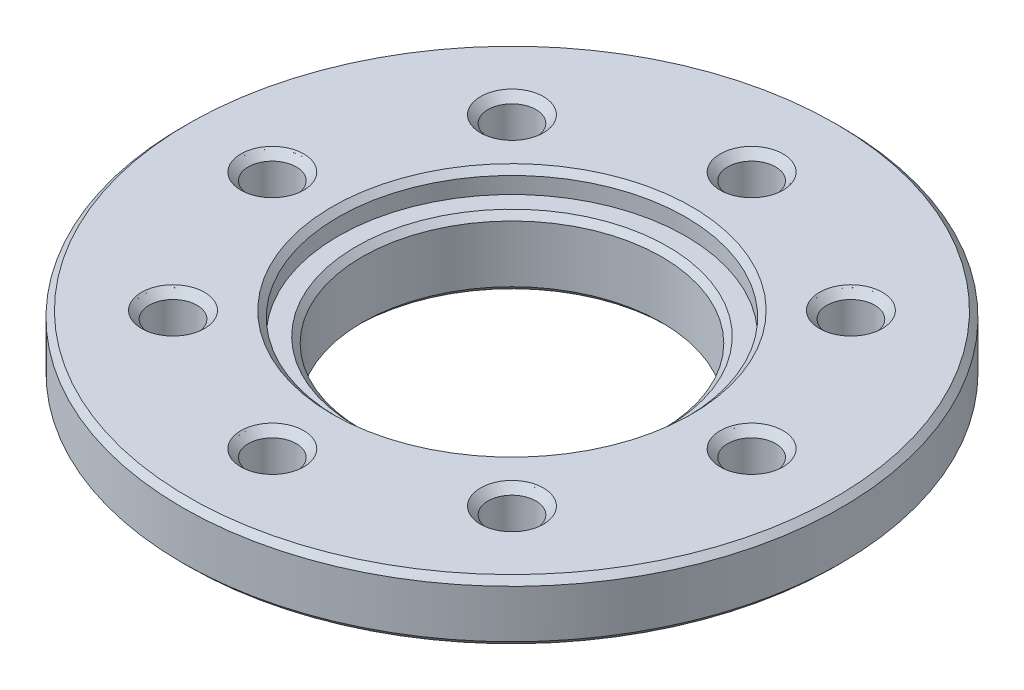
ISO-10303-21;
HEADER;
FILE_DESCRIPTION(('STEP AP214'),'2;1');
FILE_NAME('part.step','',(''),(''),'','','');
FILE_SCHEMA(('AUTOMOTIVE_DESIGN { 1 0 10303 214 1 1 1 1 }'));
ENDSEC;
DATA;
#1=APPLICATION_CONTEXT('core data for automotive mechanical design processes');
#2=APPLICATION_PROTOCOL_DEFINITION('international standard','automotive_design',2000,#1);
#3=PRODUCT_CONTEXT('',#1,'mechanical');
#4=PRODUCT('Part','Part','',(#3));
#5=PRODUCT_RELATED_PRODUCT_CATEGORY('part','',(#4));
#6=PRODUCT_DEFINITION_FORMATION('','',#4);
#7=PRODUCT_DEFINITION_CONTEXT('part definition',#1,'design');
#8=PRODUCT_DEFINITION('design','',#6,#7);
#9=PRODUCT_DEFINITION_SHAPE('','',#8);
#10=(LENGTH_UNIT() NAMED_UNIT(*) SI_UNIT(.MILLI.,.METRE.));
#11=(NAMED_UNIT(*) PLANE_ANGLE_UNIT() SI_UNIT($,.RADIAN.));
#12=(NAMED_UNIT(*) SI_UNIT($,.STERADIAN.) SOLID_ANGLE_UNIT());
#13=UNCERTAINTY_MEASURE_WITH_UNIT(LENGTH_MEASURE(1.E-05),#10,'distance_accuracy_value','');
#14=(GEOMETRIC_REPRESENTATION_CONTEXT(3) GLOBAL_UNCERTAINTY_ASSIGNED_CONTEXT((#13)) GLOBAL_UNIT_ASSIGNED_CONTEXT((#10,
#11,#12)) REPRESENTATION_CONTEXT('',''));
#15=CARTESIAN_POINT('',(0.,0.,0.));
#16=DIRECTION('',(0.,0.,1.));
#17=DIRECTION('',(1.,0.,0.));
#18=AXIS2_PLACEMENT_3D('',#15,#16,#17);
#19=CARTESIAN_POINT('',(5.656854249492,-3.52275,5.656854249492));
#20=DIRECTION('',(0.,1.,0.));
#21=DIRECTION('',(0.,0.,1.));
#22=AXIS2_PLACEMENT_3D('',#19,#20,#21);
#23=CYLINDRICAL_SURFACE('',#22,1.);
#24=CARTESIAN_POINT('',(5.656854249492,-0.0500000000000001,5.656854249492));
#25=DIRECTION('',(0.,1.,0.));
#26=DIRECTION('',(0.,0.,1.));
#27=AXIS2_PLACEMENT_3D('',#24,#25,#26);
#28=CIRCLE('',#27,1.);
#29=CARTESIAN_POINT('',(5.656854249492,-0.0500000000000001,6.656854249492));
#30=VERTEX_POINT('',#29);
#31=EDGE_CURVE('P0_E10',#30,#30,#28,.F.);
#32=ORIENTED_EDGE('',*,*,#31,.T.);
#33=EDGE_LOOP('',(#32));
#34=FACE_BOUND('',#33,.T.);
#35=CARTESIAN_POINT('',(5.656854249492,-2.,5.656854249492));
#36=DIRECTION('',(0.,1.,0.));
#37=DIRECTION('',(0.,0.,1.));
#38=AXIS2_PLACEMENT_3D('',#35,#36,#37);
#39=CIRCLE('',#38,1.);
#40=CARTESIAN_POINT('',(5.656854249492,-2.,6.656854249492));
#41=VERTEX_POINT('',#40);
#42=EDGE_CURVE('P0_E16',#41,#41,#39,.T.);
#43=ORIENTED_EDGE('',*,*,#42,.T.);
#44=EDGE_LOOP('',(#43));
#45=FACE_BOUND('',#44,.T.);
#46=ADVANCED_FACE('P0_F15',(#34,#45),#23,.T.);
#47=OPEN_SHELL('',(#46));
#48=SHELL_BASED_SURFACE_MODEL('P0_B1',(#47));
#49=CARTESIAN_POINT('',(0.,-0.750000000152795,0.));
#50=DIRECTION('',(0.,1.,0.));
#51=DIRECTION('',(0.,0.,1.));
#52=AXIS2_PLACEMENT_3D('',#49,#50,#51);
#53=CONICAL_SURFACE('',#52,5.19999999983156,0.785398163397448);
#54=CARTESIAN_POINT('',(0.,-0.750000000039108,0.));
#55=DIRECTION('',(0.,1.,0.));
#56=DIRECTION('',(0.,0.,1.));
#57=AXIS2_PLACEMENT_3D('',#54,#55,#56);
#58=CIRCLE('',#57,5.19999999994525);
#59=CARTESIAN_POINT('',(0.,-0.750000000039108,5.19999999994525));
#60=VERTEX_POINT('',#59);
#61=EDGE_CURVE('P1_E18',#60,#60,#58,.T.);
#62=ORIENTED_EDGE('',*,*,#61,.T.);
#63=EDGE_LOOP('',(#62));
#64=FACE_BOUND('',#63,.T.);
#65=CARTESIAN_POINT('',(0.,-0.95,0.));
#66=DIRECTION('',(0.,-1.,0.));
#67=DIRECTION('',(0.,0.,-1.));
#68=AXIS2_PLACEMENT_3D('',#65,#66,#67);
#69=CIRCLE('',#68,5.);
#70=CARTESIAN_POINT('',(0.,-0.95,-5.));
#71=VERTEX_POINT('',#70);
#72=EDGE_CURVE('P1_E30',#71,#71,#69,.T.);
#73=ORIENTED_EDGE('',*,*,#72,.T.);
#74=EDGE_LOOP('',(#73));
#75=FACE_BOUND('',#74,.T.);
#76=ADVANCED_FACE('P1_F15',(#64,#75),#53,.F.);
#77=CARTESIAN_POINT('',(0.,-0.75,0.));
#78=DIRECTION('',(0.,-1.,0.));
#79=DIRECTION('',(0.,0.,-1.));
#80=AXIS2_PLACEMENT_3D('',#77,#78,#79);
#81=PLANE('',#80);
#82=ORIENTED_EDGE('',*,*,#61,.F.);
#83=EDGE_LOOP('',(#82));
#84=FACE_BOUND('',#83,.T.);
#85=CARTESIAN_POINT('',(0.,-0.75,0.));
#86=DIRECTION('',(0.,-1.,0.));
#87=DIRECTION('',(0.,0.,-1.));
#88=AXIS2_PLACEMENT_3D('',#85,#86,#87);
#89=CIRCLE('',#88,5.8);
#90=CARTESIAN_POINT('',(0.,-0.75,-5.8));
#91=VERTEX_POINT('',#90);
#92=EDGE_CURVE('P1_E95',#91,#91,#89,.F.);
#93=ORIENTED_EDGE('',*,*,#92,.T.);
#94=EDGE_LOOP('',(#93));
#95=FACE_BOUND('',#94,.T.);
#96=ADVANCED_FACE('P1_F108',(#84,#95),#81,.F.);
#97=CARTESIAN_POINT('',(0.,0.1525,0.));
#98=DIRECTION('',(0.,-1.,0.));
#99=DIRECTION('',(0.,0.,-1.));
#100=AXIS2_PLACEMENT_3D('',#97,#98,#99);
#101=CYLINDRICAL_SURFACE('',#100,5.);
#102=CARTESIAN_POINT('',(0.,-2.84999999996671,0.));
#103=DIRECTION('',(0.,-1.,0.));
#104=DIRECTION('',(-1.,0.,0.));
#105=AXIS2_PLACEMENT_3D('',#102,#103,#104);
#106=CIRCLE('',#105,4.99999999993861);
#107=CARTESIAN_POINT('',(-4.99999999993861,-2.84999999996671,0.));
#108=VERTEX_POINT('',#107);
#109=EDGE_CURVE('P1_E97',#108,#108,#106,.T.);
#110=ORIENTED_EDGE('',*,*,#109,.T.);
#111=EDGE_LOOP('',(#110));
#112=FACE_BOUND('',#111,.T.);
#113=ORIENTED_EDGE('',*,*,#72,.F.);
#114=EDGE_LOOP('',(#113));
#115=FACE_BOUND('',#114,.T.);
#116=ADVANCED_FACE('P1_F110',(#112,#115),#101,.F.);
#117=CARTESIAN_POINT('',(0.,0.1525,0.));
#118=DIRECTION('',(0.,-1.,0.));
#119=DIRECTION('',(0.,0.,-1.));
#120=AXIS2_PLACEMENT_3D('',#117,#118,#119);
#121=CYLINDRICAL_SURFACE('',#120,5.8);
#122=ORIENTED_EDGE('',*,*,#92,.F.);
#123=EDGE_LOOP('',(#122));
#124=FACE_BOUND('',#123,.T.);
#125=CARTESIAN_POINT('',(0.,-0.200000000006639,0.));
#126=DIRECTION('',(0.,1.,0.));
#127=DIRECTION('',(1.,0.,0.));
#128=AXIS2_PLACEMENT_3D('',#125,#126,#127);
#129=CIRCLE('',#128,5.80000000002201);
#130=CARTESIAN_POINT('',(5.80000000002201,-0.200000000006639,0.));
#131=VERTEX_POINT('',#130);
#132=EDGE_CURVE('P1_E94',#131,#131,#129,.T.);
#133=ORIENTED_EDGE('',*,*,#132,.T.);
#134=EDGE_LOOP('',(#133));
#135=FACE_BOUND('',#134,.T.);
#136=ADVANCED_FACE('P1_F116',(#124,#135),#121,.F.);
#137=CARTESIAN_POINT('',(0.,-3.04999999985966,0.));
#138=DIRECTION('',(0.,-1.,0.));
#139=DIRECTION('',(0.,0.,-1.));
#140=AXIS2_PLACEMENT_3D('',#137,#138,#139);
#141=CONICAL_SURFACE('',#140,5.19999999983156,0.785398163397448);
#142=ORIENTED_EDGE('',*,*,#109,.F.);
#143=EDGE_LOOP('',(#142));
#144=FACE_BOUND('',#143,.T.);
#145=CARTESIAN_POINT('',(0.,-3.04999999997335,0.));
#146=DIRECTION('',(0.,-1.,0.));
#147=DIRECTION('',(0.,0.,-1.));
#148=AXIS2_PLACEMENT_3D('',#145,#146,#147);
#149=CIRCLE('',#148,5.19999999994525);
#150=CARTESIAN_POINT('',(0.,-3.04999999997335,-5.19999999994525));
#151=VERTEX_POINT('',#150);
#152=EDGE_CURVE('P1_E92',#151,#151,#149,.F.);
#153=ORIENTED_EDGE('',*,*,#152,.F.);
#154=EDGE_LOOP('',(#153));
#155=FACE_BOUND('',#154,.T.);
#156=ADVANCED_FACE('P1_F221',(#144,#155),#141,.F.);
#157=CARTESIAN_POINT('',(0.,-5.6843418860808E-11,0.));
#158=DIRECTION('',(0.,1.,0.));
#159=DIRECTION('',(0.,0.,1.));
#160=AXIS2_PLACEMENT_3D('',#157,#158,#159);
#161=CONICAL_SURFACE('',#160,5.99999999997181,0.785398163397448);
#162=CARTESIAN_POINT('',(0.,-5.6843418860808E-11,0.));
#163=DIRECTION('',(0.,1.,0.));
#164=DIRECTION('',(0.,0.,1.));
#165=AXIS2_PLACEMENT_3D('',#162,#163,#164);
#166=CIRCLE('',#165,5.99999999997181);
#167=CARTESIAN_POINT('',(0.,-5.6843418860808E-11,5.99999999997181));
#168=VERTEX_POINT('',#167);
#169=EDGE_CURVE('P1_E86',#168,#168,#166,.T.);
#170=ORIENTED_EDGE('',*,*,#169,.T.);
#171=EDGE_LOOP('',(#170));
#172=FACE_BOUND('',#171,.T.);
#173=ORIENTED_EDGE('',*,*,#132,.F.);
#174=EDGE_LOOP('',(#173));
#175=FACE_BOUND('',#174,.T.);
#176=ADVANCED_FACE('P1_F217',(#172,#175),#161,.F.);
#177=CARTESIAN_POINT('',(0.,-0.200000000000015,0.));
#178=DIRECTION('',(0.,-1.,0.));
#179=DIRECTION('',(0.,0.,-1.));
#180=AXIS2_PLACEMENT_3D('',#177,#178,#179);
#181=CONICAL_SURFACE('',#180,11.,0.7853981633973);
#182=CARTESIAN_POINT('',(0.,-0.2,0.));
#183=DIRECTION('',(0.,-1.,0.));
#184=DIRECTION('',(0.,0.,-1.));
#185=AXIS2_PLACEMENT_3D('',#182,#183,#184);
#186=CIRCLE('',#185,11.);
#187=CARTESIAN_POINT('',(0.,-0.2,-11.));
#188=VERTEX_POINT('',#187);
#189=EDGE_CURVE('P1_E85',#188,#188,#186,.T.);
#190=ORIENTED_EDGE('',*,*,#189,.F.);
#191=EDGE_LOOP('',(#190));
#192=FACE_BOUND('',#191,.T.);
#193=CARTESIAN_POINT('',(0.,0.,0.));
#194=DIRECTION('',(0.,-1.,0.));
#195=DIRECTION('',(0.,0.,-1.));
#196=AXIS2_PLACEMENT_3D('',#193,#194,#195);
#197=CIRCLE('',#196,10.8);
#198=CARTESIAN_POINT('',(0.,0.,-10.8));
#199=VERTEX_POINT('',#198);
#200=EDGE_CURVE('P1_E89',#199,#199,#197,.T.);
#201=ORIENTED_EDGE('',*,*,#200,.T.);
#202=EDGE_LOOP('',(#201));
#203=FACE_BOUND('',#202,.T.);
#204=ADVANCED_FACE('P1_F213',(#192,#203),#181,.T.);
#205=CARTESIAN_POINT('',(0.,-3.05,0.));
#206=DIRECTION('',(0.,-1.,0.));
#207=DIRECTION('',(0.,0.,-1.));
#208=AXIS2_PLACEMENT_3D('',#205,#206,#207);
#209=PLANE('',#208);
#210=ORIENTED_EDGE('',*,*,#152,.T.);
#211=EDGE_LOOP('',(#210));
#212=FACE_BOUND('',#211,.T.);
#213=CARTESIAN_POINT('',(0.,-3.0500000000302,0.));
#214=DIRECTION('',(0.,1.,0.));
#215=DIRECTION('',(0.,0.,1.));
#216=AXIS2_PLACEMENT_3D('',#213,#214,#215);
#217=CIRCLE('',#216,6.04999999995925);
#218=CARTESIAN_POINT('',(0.,-3.0500000000302,6.04999999995925));
#219=VERTEX_POINT('',#218);
#220=EDGE_CURVE('P1_E82',#219,#219,#217,.T.);
#221=ORIENTED_EDGE('',*,*,#220,.F.);
#222=EDGE_LOOP('',(#221));
#223=FACE_BOUND('',#222,.T.);
#224=ADVANCED_FACE('P1_F209',(#212,#223),#209,.T.);
#225=CARTESIAN_POINT('',(0.,0.,0.));
#226=DIRECTION('',(0.,-1.,0.));
#227=DIRECTION('',(0.,0.,-1.));
#228=AXIS2_PLACEMENT_3D('',#225,#226,#227);
#229=PLANE('',#228);
#230=CARTESIAN_POINT('',(-5.656854249492,0.,-5.656854249492));
#231=DIRECTION('',(0.,1.,0.));
#232=DIRECTION('',(0.,0.,1.));
#233=AXIS2_PLACEMENT_3D('',#230,#231,#232);
#234=CIRCLE('',#233,1.04999999997565);
#235=CARTESIAN_POINT('',(-5.656854249492,0.,-4.60685424951635));
#236=VERTEX_POINT('',#235);
#237=EDGE_CURVE('P1_E57',#236,#236,#234,.F.);
#238=ORIENTED_EDGE('',*,*,#237,.T.);
#239=EDGE_LOOP('',(#238));
#240=FACE_BOUND('',#239,.T.);
#241=CARTESIAN_POINT('',(-8.,0.,0.));
#242=DIRECTION('',(0.,1.,0.));
#243=DIRECTION('',(0.,0.,1.));
#244=AXIS2_PLACEMENT_3D('',#241,#242,#243);
#245=CIRCLE('',#244,1.05000000003929);
#246=CARTESIAN_POINT('',(-8.,0.,1.05000000003929));
#247=VERTEX_POINT('',#246);
#248=EDGE_CURVE('P1_E61',#247,#247,#245,.F.);
#249=ORIENTED_EDGE('',*,*,#248,.T.);
#250=EDGE_LOOP('',(#249));
#251=FACE_BOUND('',#250,.T.);
#252=CARTESIAN_POINT('',(-5.656854249492,0.,5.656854249492));
#253=DIRECTION('',(0.,1.,0.));
#254=DIRECTION('',(0.,0.,1.));
#255=AXIS2_PLACEMENT_3D('',#252,#253,#254);
#256=CIRCLE('',#255,1.04999999997565);
#257=CARTESIAN_POINT('',(-5.656854249492,0.,6.70685424946765));
#258=VERTEX_POINT('',#257);
#259=EDGE_CURVE('P1_E64',#258,#258,#256,.F.);
#260=ORIENTED_EDGE('',*,*,#259,.T.);
#261=EDGE_LOOP('',(#260));
#262=FACE_BOUND('',#261,.T.);
#263=CARTESIAN_POINT('',(0.,-5.6843418860808E-11,8.));
#264=DIRECTION('',(0.,1.,0.));
#265=DIRECTION('',(0.,0.,1.));
#266=AXIS2_PLACEMENT_3D('',#263,#264,#265);
#267=CIRCLE('',#266,1.04999999990696);
#268=CARTESIAN_POINT('',(0.,-5.6843418860808E-11,9.04999999990696));
#269=VERTEX_POINT('',#268);
#270=EDGE_CURVE('P1_E67',#269,#269,#267,.F.);
#271=ORIENTED_EDGE('',*,*,#270,.T.);
#272=EDGE_LOOP('',(#271));
#273=FACE_BOUND('',#272,.T.);
#274=CARTESIAN_POINT('',(5.656854249492,0.,5.656854249492));
#275=DIRECTION('',(0.,1.,0.));
#276=DIRECTION('',(0.,0.,1.));
#277=AXIS2_PLACEMENT_3D('',#274,#275,#276);
#278=CIRCLE('',#277,1.04999999995195);
#279=CARTESIAN_POINT('',(5.656854249492,0.,6.70685424944395));
#280=VERTEX_POINT('',#279);
#281=EDGE_CURVE('P1_E70',#280,#280,#278,.F.);
#282=ORIENTED_EDGE('',*,*,#281,.T.);
#283=EDGE_LOOP('',(#282));
#284=FACE_BOUND('',#283,.T.);
#285=CARTESIAN_POINT('',(8.,0.,0.));
#286=DIRECTION('',(0.,1.,0.));
#287=DIRECTION('',(0.,0.,1.));
#288=AXIS2_PLACEMENT_3D('',#285,#286,#287);
#289=CIRCLE('',#288,1.050000000002);
#290=CARTESIAN_POINT('',(8.,0.,1.050000000002));
#291=VERTEX_POINT('',#290);
#292=EDGE_CURVE('P1_E73',#291,#291,#289,.F.);
#293=ORIENTED_EDGE('',*,*,#292,.T.);
#294=EDGE_LOOP('',(#293));
#295=FACE_BOUND('',#294,.T.);
#296=CARTESIAN_POINT('',(5.656854249492,0.,-5.656854249492));
#297=DIRECTION('',(0.,1.,0.));
#298=DIRECTION('',(0.,0.,1.));
#299=AXIS2_PLACEMENT_3D('',#296,#297,#298);
#300=CIRCLE('',#299,1.04999999995195);
#301=CARTESIAN_POINT('',(5.656854249492,0.,-4.60685424954005));
#302=VERTEX_POINT('',#301);
#303=EDGE_CURVE('P1_E76',#302,#302,#300,.F.);
#304=ORIENTED_EDGE('',*,*,#303,.T.);
#305=EDGE_LOOP('',(#304));
#306=FACE_BOUND('',#305,.T.);
#307=CARTESIAN_POINT('',(0.,-5.6843418860808E-11,-8.));
#308=DIRECTION('',(0.,1.,0.));
#309=DIRECTION('',(0.,0.,1.));
#310=AXIS2_PLACEMENT_3D('',#307,#308,#309);
#311=CIRCLE('',#310,1.04999999990696);
#312=CARTESIAN_POINT('',(0.,-5.6843418860808E-11,-6.95000000009304));
#313=VERTEX_POINT('',#312);
#314=EDGE_CURVE('P1_E79',#313,#313,#311,.F.);
#315=ORIENTED_EDGE('',*,*,#314,.T.);
#316=EDGE_LOOP('',(#315));
#317=FACE_BOUND('',#316,.T.);
#318=ORIENTED_EDGE('',*,*,#169,.F.);
#319=EDGE_LOOP('',(#318));
#320=FACE_BOUND('',#319,.T.);
#321=ORIENTED_EDGE('',*,*,#200,.F.);
#322=EDGE_LOOP('',(#321));
#323=FACE_BOUND('',#322,.T.);
#324=ADVANCED_FACE('P1_F205',(#240,#251,#262,#273,#284,#295,#306,#317,#320,#323),#229,.F.);
#325=CARTESIAN_POINT('',(0.,0.1525,0.));
#326=DIRECTION('',(0.,-1.,0.));
#327=DIRECTION('',(0.,0.,-1.));
#328=AXIS2_PLACEMENT_3D('',#325,#326,#327);
#329=CYLINDRICAL_SURFACE('',#328,11.);
#330=CARTESIAN_POINT('',(0.,-1.79999999999999,0.));
#331=DIRECTION('',(0.,1.,0.));
#332=DIRECTION('',(1.,0.,0.));
#333=AXIS2_PLACEMENT_3D('',#330,#331,#332);
#334=CIRCLE('',#333,11.);
#335=CARTESIAN_POINT('',(11.,-1.79999999999998,0.));
#336=VERTEX_POINT('',#335);
#337=EDGE_CURVE('P1_E60',#336,#336,#334,.F.);
#338=ORIENTED_EDGE('',*,*,#337,.F.);
#339=EDGE_LOOP('',(#338));
#340=FACE_BOUND('',#339,.T.);
#341=ORIENTED_EDGE('',*,*,#189,.T.);
#342=EDGE_LOOP('',(#341));
#343=FACE_BOUND('',#342,.T.);
#344=ADVANCED_FACE('P1_F201',(#340,#343),#329,.T.);
#345=CARTESIAN_POINT('',(0.,-2.8500000000804,0.));
#346=DIRECTION('',(0.,1.,0.));
#347=DIRECTION('',(0.,0.,1.));
#348=AXIS2_PLACEMENT_3D('',#345,#346,#347);
#349=CONICAL_SURFACE('',#348,6.24999999990905,0.785398163397448);
#350=ORIENTED_EDGE('',*,*,#220,.T.);
#351=EDGE_LOOP('',(#350));
#352=FACE_BOUND('',#351,.T.);
#353=CARTESIAN_POINT('',(0.,-2.85,0.));
#354=DIRECTION('',(0.,-1.,0.));
#355=DIRECTION('',(0.,0.,-1.));
#356=AXIS2_PLACEMENT_3D('',#353,#354,#355);
#357=CIRCLE('',#356,6.25);
#358=CARTESIAN_POINT('',(0.,-2.85,-6.25));
#359=VERTEX_POINT('',#358);
#360=EDGE_CURVE('P1_E240',#359,#359,#357,.F.);
#361=ORIENTED_EDGE('',*,*,#360,.F.);
#362=EDGE_LOOP('',(#361));
#363=FACE_BOUND('',#362,.T.);
#364=ADVANCED_FACE('P1_F197',(#352,#363),#349,.T.);
#365=CARTESIAN_POINT('',(0.,-1.70530256582424E-10,-8.));
#366=DIRECTION('',(0.,1.,0.));
#367=DIRECTION('',(0.,0.,1.));
#368=AXIS2_PLACEMENT_3D('',#365,#366,#367);
#369=CONICAL_SURFACE('',#368,1.04999999979327,0.785398163397448);
#370=CARTESIAN_POINT('',(0.,-0.25,-8.));
#371=DIRECTION('',(0.,1.,0.));
#372=DIRECTION('',(0.,0.,1.));
#373=AXIS2_PLACEMENT_3D('',#370,#371,#372);
#374=CIRCLE('',#373,0.8);
#375=CARTESIAN_POINT('',(0.,-0.25,-7.2));
#376=VERTEX_POINT('',#375);
#377=EDGE_CURVE('P1_E243',#376,#376,#374,.F.);
#378=ORIENTED_EDGE('',*,*,#377,.T.);
#379=EDGE_LOOP('',(#378));
#380=FACE_BOUND('',#379,.T.);
#381=ORIENTED_EDGE('',*,*,#314,.F.);
#382=EDGE_LOOP('',(#381));
#383=FACE_BOUND('',#382,.T.);
#384=ADVANCED_FACE('P1_F193',(#380,#383),#369,.F.);
#385=CARTESIAN_POINT('',(5.656854249492,-5.6843418860808E-11,-5.656854249492));
#386=DIRECTION('',(0.,1.,0.));
#387=DIRECTION('',(0.,0.,1.));
#388=AXIS2_PLACEMENT_3D('',#385,#386,#387);
#389=CONICAL_SURFACE('',#388,1.04999999989511,0.785398163283761);
#390=CARTESIAN_POINT('',(5.656854249492,-0.25,-5.656854249492));
#391=DIRECTION('',(0.,1.,0.));
#392=DIRECTION('',(0.,0.,1.));
#393=AXIS2_PLACEMENT_3D('',#390,#391,#392);
#394=CIRCLE('',#393,0.8);
#395=CARTESIAN_POINT('',(5.656854249492,-0.25,-4.856854249492));
#396=VERTEX_POINT('',#395);
#397=EDGE_CURVE('P1_E246',#396,#396,#394,.F.);
#398=ORIENTED_EDGE('',*,*,#397,.T.);
#399=EDGE_LOOP('',(#398));
#400=FACE_BOUND('',#399,.T.);
#401=ORIENTED_EDGE('',*,*,#303,.F.);
#402=EDGE_LOOP('',(#401));
#403=FACE_BOUND('',#402,.T.);
#404=ADVANCED_FACE('P1_F189',(#400,#403),#389,.F.);
#405=CARTESIAN_POINT('',(8.,-1.13686837721616E-10,0.));
#406=DIRECTION('',(0.,1.,0.));
#407=DIRECTION('',(0.,0.,1.));
#408=AXIS2_PLACEMENT_3D('',#405,#406,#407);
#409=CONICAL_SURFACE('',#408,1.04999999988831,0.785398163397448);
#410=CARTESIAN_POINT('',(8.,-0.25,0.));
#411=DIRECTION('',(0.,1.,0.));
#412=DIRECTION('',(0.,0.,1.));
#413=AXIS2_PLACEMENT_3D('',#410,#411,#412);
#414=CIRCLE('',#413,0.8);
#415=CARTESIAN_POINT('',(8.,-0.25,0.8));
#416=VERTEX_POINT('',#415);
#417=EDGE_CURVE('P1_E249',#416,#416,#414,.F.);
#418=ORIENTED_EDGE('',*,*,#417,.T.);
#419=EDGE_LOOP('',(#418));
#420=FACE_BOUND('',#419,.T.);
#421=ORIENTED_EDGE('',*,*,#292,.F.);
#422=EDGE_LOOP('',(#421));
#423=FACE_BOUND('',#422,.T.);
#424=ADVANCED_FACE('P1_F185',(#420,#423),#409,.F.);
#425=CARTESIAN_POINT('',(5.656854249492,-5.6843418860808E-11,5.656854249492));
#426=DIRECTION('',(0.,1.,0.));
#427=DIRECTION('',(0.,0.,1.));
#428=AXIS2_PLACEMENT_3D('',#425,#426,#427);
#429=CONICAL_SURFACE('',#428,1.04999999989511,0.785398163283761);
#430=CARTESIAN_POINT('',(5.656854249492,-0.25,5.656854249492));
#431=DIRECTION('',(0.,1.,0.));
#432=DIRECTION('',(0.,0.,1.));
#433=AXIS2_PLACEMENT_3D('',#430,#431,#432);
#434=CIRCLE('',#433,0.8);
#435=CARTESIAN_POINT('',(5.656854249492,-0.25,6.456854249492));
#436=VERTEX_POINT('',#435);
#437=EDGE_CURVE('P1_E252',#436,#436,#434,.F.);
#438=ORIENTED_EDGE('',*,*,#437,.T.);
#439=EDGE_LOOP('',(#438));
#440=FACE_BOUND('',#439,.T.);
#441=ORIENTED_EDGE('',*,*,#281,.F.);
#442=EDGE_LOOP('',(#441));
#443=FACE_BOUND('',#442,.T.);
#444=ADVANCED_FACE('P1_F181',(#440,#443),#429,.F.);
#445=CARTESIAN_POINT('',(0.,-1.70530256582424E-10,8.));
#446=DIRECTION('',(0.,1.,0.));
#447=DIRECTION('',(0.,0.,1.));
#448=AXIS2_PLACEMENT_3D('',#445,#446,#447);
#449=CONICAL_SURFACE('',#448,1.04999999979327,0.785398163397448);
#450=CARTESIAN_POINT('',(0.,-0.25,8.));
#451=DIRECTION('',(0.,1.,0.));
#452=DIRECTION('',(0.,0.,1.));
#453=AXIS2_PLACEMENT_3D('',#450,#451,#452);
#454=CIRCLE('',#453,0.8);
#455=CARTESIAN_POINT('',(0.,-0.25,8.8));
#456=VERTEX_POINT('',#455);
#457=EDGE_CURVE('P1_E255',#456,#456,#454,.F.);
#458=ORIENTED_EDGE('',*,*,#457,.T.);
#459=EDGE_LOOP('',(#458));
#460=FACE_BOUND('',#459,.T.);
#461=ORIENTED_EDGE('',*,*,#270,.F.);
#462=EDGE_LOOP('',(#461));
#463=FACE_BOUND('',#462,.T.);
#464=ADVANCED_FACE('P1_F177',(#460,#463),#449,.F.);
#465=CARTESIAN_POINT('',(-5.656854249492,-5.6843418860808E-11,5.656854249492));
#466=DIRECTION('',(0.,1.,0.));
#467=DIRECTION('',(0.,0.,1.));
#468=AXIS2_PLACEMENT_3D('',#465,#466,#467);
#469=CONICAL_SURFACE('',#468,1.04999999991881,0.785398163397448);
#470=CARTESIAN_POINT('',(-5.656854249492,-0.25,5.656854249492));
#471=DIRECTION('',(0.,1.,0.));
#472=DIRECTION('',(0.,0.,1.));
#473=AXIS2_PLACEMENT_3D('',#470,#471,#472);
#474=CIRCLE('',#473,0.8);
#475=CARTESIAN_POINT('',(-5.656854249492,-0.25,6.456854249492));
#476=VERTEX_POINT('',#475);
#477=EDGE_CURVE('P1_E258',#476,#476,#474,.F.);
#478=ORIENTED_EDGE('',*,*,#477,.T.);
#479=EDGE_LOOP('',(#478));
#480=FACE_BOUND('',#479,.T.);
#481=ORIENTED_EDGE('',*,*,#259,.F.);
#482=EDGE_LOOP('',(#481));
#483=FACE_BOUND('',#482,.T.);
#484=ADVANCED_FACE('P1_F173',(#480,#483),#469,.F.);
#485=CARTESIAN_POINT('',(-8.,-5.6843418860808E-11,0.));
#486=DIRECTION('',(0.,1.,0.));
#487=DIRECTION('',(0.,0.,1.));
#488=AXIS2_PLACEMENT_3D('',#485,#486,#487);
#489=CONICAL_SURFACE('',#488,1.04999999998245,0.785398163397448);
#490=CARTESIAN_POINT('',(-8.,-0.25,0.));
#491=DIRECTION('',(0.,1.,0.));
#492=DIRECTION('',(0.,0.,1.));
#493=AXIS2_PLACEMENT_3D('',#490,#491,#492);
#494=CIRCLE('',#493,0.8);
#495=CARTESIAN_POINT('',(-8.,-0.25,0.8));
#496=VERTEX_POINT('',#495);
#497=EDGE_CURVE('P1_E261',#496,#496,#494,.F.);
#498=ORIENTED_EDGE('',*,*,#497,.T.);
#499=EDGE_LOOP('',(#498));
#500=FACE_BOUND('',#499,.T.);
#501=ORIENTED_EDGE('',*,*,#248,.F.);
#502=EDGE_LOOP('',(#501));
#503=FACE_BOUND('',#502,.T.);
#504=ADVANCED_FACE('P1_F169',(#500,#503),#489,.F.);
#505=CARTESIAN_POINT('',(-5.656854249492,-5.6843418860808E-11,-5.656854249492));
#506=DIRECTION('',(0.,1.,0.));
#507=DIRECTION('',(0.,0.,1.));
#508=AXIS2_PLACEMENT_3D('',#505,#506,#507);
#509=CONICAL_SURFACE('',#508,1.04999999991881,0.785398163397448);
#510=CARTESIAN_POINT('',(-5.656854249492,-0.25,-5.656854249492));
#511=DIRECTION('',(0.,1.,0.));
#512=DIRECTION('',(0.,0.,1.));
#513=AXIS2_PLACEMENT_3D('',#510,#511,#512);
#514=CIRCLE('',#513,0.8);
#515=CARTESIAN_POINT('',(-5.656854249492,-0.25,-4.856854249492));
#516=VERTEX_POINT('',#515);
#517=EDGE_CURVE('P1_E56',#516,#516,#514,.F.);
#518=ORIENTED_EDGE('',*,*,#517,.T.);
#519=EDGE_LOOP('',(#518));
#520=FACE_BOUND('',#519,.T.);
#521=ORIENTED_EDGE('',*,*,#237,.F.);
#522=EDGE_LOOP('',(#521));
#523=FACE_BOUND('',#522,.T.);
#524=ADVANCED_FACE('P1_F165',(#520,#523),#509,.F.);
#525=CARTESIAN_POINT('',(0.,-1.79999999999999,0.));
#526=DIRECTION('',(0.,1.,0.));
#527=DIRECTION('',(0.,0.,1.));
#528=AXIS2_PLACEMENT_3D('',#525,#526,#527);
#529=CONICAL_SURFACE('',#528,11.,0.785398163397302);
#530=CARTESIAN_POINT('',(0.,-2.00000000000001,0.));
#531=DIRECTION('',(0.,1.,0.));
#532=DIRECTION('',(0.,0.,1.));
#533=AXIS2_PLACEMENT_3D('',#530,#531,#532);
#534=CIRCLE('',#533,10.8);
#535=CARTESIAN_POINT('',(0.,-2.00000000000001,10.8));
#536=VERTEX_POINT('',#535);
#537=EDGE_CURVE('P1_E53',#536,#536,#534,.F.);
#538=ORIENTED_EDGE('',*,*,#537,.F.);
#539=EDGE_LOOP('',(#538));
#540=FACE_BOUND('',#539,.T.);
#541=ORIENTED_EDGE('',*,*,#337,.T.);
#542=EDGE_LOOP('',(#541));
#543=FACE_BOUND('',#542,.T.);
#544=ADVANCED_FACE('P1_F161',(#540,#543),#529,.T.);
#545=CARTESIAN_POINT('',(0.,0.1525,0.));
#546=DIRECTION('',(0.,-1.,0.));
#547=DIRECTION('',(0.,0.,-1.));
#548=AXIS2_PLACEMENT_3D('',#545,#546,#547);
#549=CYLINDRICAL_SURFACE('',#548,6.25);
#550=CARTESIAN_POINT('',(0.,-2.,0.));
#551=DIRECTION('',(0.,-1.,0.));
#552=DIRECTION('',(0.,0.,-1.));
#553=AXIS2_PLACEMENT_3D('',#550,#551,#552);
#554=CIRCLE('',#553,6.25);
#555=CARTESIAN_POINT('',(0.,-2.,-6.25));
#556=VERTEX_POINT('',#555);
#557=EDGE_CURVE('P1_E50',#556,#556,#554,.F.);
#558=ORIENTED_EDGE('',*,*,#557,.F.);
#559=EDGE_LOOP('',(#558));
#560=FACE_BOUND('',#559,.T.);
#561=ORIENTED_EDGE('',*,*,#360,.T.);
#562=EDGE_LOOP('',(#561));
#563=FACE_BOUND('',#562,.T.);
#564=ADVANCED_FACE('P1_F157',(#560,#563),#549,.T.);
#565=CARTESIAN_POINT('',(0.,-3.52275,-8.));
#566=DIRECTION('',(0.,1.,0.));
#567=DIRECTION('',(0.,0.,1.));
#568=AXIS2_PLACEMENT_3D('',#565,#566,#567);
#569=CYLINDRICAL_SURFACE('',#568,0.8);
#570=ORIENTED_EDGE('',*,*,#377,.F.);
#571=EDGE_LOOP('',(#570));
#572=FACE_BOUND('',#571,.T.);
#573=CARTESIAN_POINT('',(0.,-2.,-8.));
#574=DIRECTION('',(0.,1.,0.));
#575=DIRECTION('',(0.,0.,1.));
#576=AXIS2_PLACEMENT_3D('',#573,#574,#575);
#577=CIRCLE('',#576,0.8);
#578=CARTESIAN_POINT('',(0.,-2.,-7.2));
#579=VERTEX_POINT('',#578);
#580=EDGE_CURVE('P1_E47',#579,#579,#577,.T.);
#581=ORIENTED_EDGE('',*,*,#580,.F.);
#582=EDGE_LOOP('',(#581));
#583=FACE_BOUND('',#582,.T.);
#584=ADVANCED_FACE('P1_F153',(#572,#583),#569,.F.);
#585=CARTESIAN_POINT('',(5.656854249492,-3.52275,-5.656854249492));
#586=DIRECTION('',(0.,1.,0.));
#587=DIRECTION('',(0.,0.,1.));
#588=AXIS2_PLACEMENT_3D('',#585,#586,#587);
#589=CYLINDRICAL_SURFACE('',#588,0.8);
#590=ORIENTED_EDGE('',*,*,#397,.F.);
#591=EDGE_LOOP('',(#590));
#592=FACE_BOUND('',#591,.T.);
#593=CARTESIAN_POINT('',(5.656854249492,-2.,-5.656854249492));
#594=DIRECTION('',(0.,1.,0.));
#595=DIRECTION('',(0.,0.,1.));
#596=AXIS2_PLACEMENT_3D('',#593,#594,#595);
#597=CIRCLE('',#596,0.8);
#598=CARTESIAN_POINT('',(5.656854249492,-2.,-4.856854249492));
#599=VERTEX_POINT('',#598);
#600=EDGE_CURVE('P1_E44',#599,#599,#597,.T.);
#601=ORIENTED_EDGE('',*,*,#600,.F.);
#602=EDGE_LOOP('',(#601));
#603=FACE_BOUND('',#602,.T.);
#604=ADVANCED_FACE('P1_F149',(#592,#603),#589,.F.);
#605=CARTESIAN_POINT('',(8.,-3.52275,0.));
#606=DIRECTION('',(0.,1.,0.));
#607=DIRECTION('',(0.,0.,1.));
#608=AXIS2_PLACEMENT_3D('',#605,#606,#607);
#609=CYLINDRICAL_SURFACE('',#608,0.8);
#610=ORIENTED_EDGE('',*,*,#417,.F.);
#611=EDGE_LOOP('',(#610));
#612=FACE_BOUND('',#611,.T.);
#613=CARTESIAN_POINT('',(8.,-2.,0.));
#614=DIRECTION('',(0.,1.,0.));
#615=DIRECTION('',(0.,0.,1.));
#616=AXIS2_PLACEMENT_3D('',#613,#614,#615);
#617=CIRCLE('',#616,0.8);
#618=CARTESIAN_POINT('',(8.,-2.,0.8));
#619=VERTEX_POINT('',#618);
#620=EDGE_CURVE('P1_E41',#619,#619,#617,.T.);
#621=ORIENTED_EDGE('',*,*,#620,.F.);
#622=EDGE_LOOP('',(#621));
#623=FACE_BOUND('',#622,.T.);
#624=ADVANCED_FACE('P1_F145',(#612,#623),#609,.F.);
#625=CARTESIAN_POINT('',(5.656854249492,-3.52275,5.656854249492));
#626=DIRECTION('',(0.,1.,0.));
#627=DIRECTION('',(0.,0.,1.));
#628=AXIS2_PLACEMENT_3D('',#625,#626,#627);
#629=CYLINDRICAL_SURFACE('',#628,0.8);
#630=ORIENTED_EDGE('',*,*,#437,.F.);
#631=EDGE_LOOP('',(#630));
#632=FACE_BOUND('',#631,.T.);
#633=CARTESIAN_POINT('',(5.656854249492,-2.,5.656854249492));
#634=DIRECTION('',(0.,1.,0.));
#635=DIRECTION('',(0.,0.,1.));
#636=AXIS2_PLACEMENT_3D('',#633,#634,#635);
#637=CIRCLE('',#636,0.8);
#638=CARTESIAN_POINT('',(5.656854249492,-2.,6.456854249492));
#639=VERTEX_POINT('',#638);
#640=EDGE_CURVE('P1_E38',#639,#639,#637,.T.);
#641=ORIENTED_EDGE('',*,*,#640,.F.);
#642=EDGE_LOOP('',(#641));
#643=FACE_BOUND('',#642,.T.);
#644=ADVANCED_FACE('P1_F141',(#632,#643),#629,.F.);
#645=CARTESIAN_POINT('',(0.,-3.52275,8.));
#646=DIRECTION('',(0.,1.,0.));
#647=DIRECTION('',(0.,0.,1.));
#648=AXIS2_PLACEMENT_3D('',#645,#646,#647);
#649=CYLINDRICAL_SURFACE('',#648,0.8);
#650=ORIENTED_EDGE('',*,*,#457,.F.);
#651=EDGE_LOOP('',(#650));
#652=FACE_BOUND('',#651,.T.);
#653=CARTESIAN_POINT('',(0.,-2.,8.));
#654=DIRECTION('',(0.,1.,0.));
#655=DIRECTION('',(0.,0.,1.));
#656=AXIS2_PLACEMENT_3D('',#653,#654,#655);
#657=CIRCLE('',#656,0.8);
#658=CARTESIAN_POINT('',(0.,-2.,8.8));
#659=VERTEX_POINT('',#658);
#660=EDGE_CURVE('P1_E35',#659,#659,#657,.T.);
#661=ORIENTED_EDGE('',*,*,#660,.F.);
#662=EDGE_LOOP('',(#661));
#663=FACE_BOUND('',#662,.T.);
#664=ADVANCED_FACE('P1_F137',(#652,#663),#649,.F.);
#665=CARTESIAN_POINT('',(-5.656854249492,-3.52275,5.656854249492));
#666=DIRECTION('',(0.,1.,0.));
#667=DIRECTION('',(0.,0.,1.));
#668=AXIS2_PLACEMENT_3D('',#665,#666,#667);
#669=CYLINDRICAL_SURFACE('',#668,0.8);
#670=ORIENTED_EDGE('',*,*,#477,.F.);
#671=EDGE_LOOP('',(#670));
#672=FACE_BOUND('',#671,.T.);
#673=CARTESIAN_POINT('',(-5.656854249492,-2.,5.656854249492));
#674=DIRECTION('',(0.,1.,0.));
#675=DIRECTION('',(0.,0.,1.));
#676=AXIS2_PLACEMENT_3D('',#673,#674,#675);
#677=CIRCLE('',#676,0.8);
#678=CARTESIAN_POINT('',(-5.656854249492,-2.,6.456854249492));
#679=VERTEX_POINT('',#678);
#680=EDGE_CURVE('P1_E27',#679,#679,#677,.T.);
#681=ORIENTED_EDGE('',*,*,#680,.F.);
#682=EDGE_LOOP('',(#681));
#683=FACE_BOUND('',#682,.T.);
#684=ADVANCED_FACE('P1_F133',(#672,#683),#669,.F.);
#685=CARTESIAN_POINT('',(-8.,-3.52275,0.));
#686=DIRECTION('',(0.,1.,0.));
#687=DIRECTION('',(0.,0.,1.));
#688=AXIS2_PLACEMENT_3D('',#685,#686,#687);
#689=CYLINDRICAL_SURFACE('',#688,0.8);
#690=ORIENTED_EDGE('',*,*,#497,.F.);
#691=EDGE_LOOP('',(#690));
#692=FACE_BOUND('',#691,.T.);
#693=CARTESIAN_POINT('',(-8.,-2.,0.));
#694=DIRECTION('',(0.,1.,0.));
#695=DIRECTION('',(0.,0.,1.));
#696=AXIS2_PLACEMENT_3D('',#693,#694,#695);
#697=CIRCLE('',#696,0.8);
#698=CARTESIAN_POINT('',(-8.,-2.,0.8));
#699=VERTEX_POINT('',#698);
#700=EDGE_CURVE('P1_E22',#699,#699,#697,.T.);
#701=ORIENTED_EDGE('',*,*,#700,.F.);
#702=EDGE_LOOP('',(#701));
#703=FACE_BOUND('',#702,.T.);
#704=ADVANCED_FACE('P1_F126',(#692,#703),#689,.F.);
#705=CARTESIAN_POINT('',(-5.656854249492,-3.52275,-5.656854249492));
#706=DIRECTION('',(0.,1.,0.));
#707=DIRECTION('',(0.,0.,1.));
#708=AXIS2_PLACEMENT_3D('',#705,#706,#707);
#709=CYLINDRICAL_SURFACE('',#708,0.8);
#710=ORIENTED_EDGE('',*,*,#517,.F.);
#711=EDGE_LOOP('',(#710));
#712=FACE_BOUND('',#711,.T.);
#713=CARTESIAN_POINT('',(-5.656854249492,-2.,-5.656854249492));
#714=DIRECTION('',(0.,1.,0.));
#715=DIRECTION('',(0.,0.,1.));
#716=AXIS2_PLACEMENT_3D('',#713,#714,#715);
#717=CIRCLE('',#716,0.8);
#718=CARTESIAN_POINT('',(-5.656854249492,-2.,-4.856854249492));
#719=VERTEX_POINT('',#718);
#720=EDGE_CURVE('P1_E10',#719,#719,#717,.T.);
#721=ORIENTED_EDGE('',*,*,#720,.F.);
#722=EDGE_LOOP('',(#721));
#723=FACE_BOUND('',#722,.T.);
#724=ADVANCED_FACE('P1_F121',(#712,#723),#709,.F.);
#725=CARTESIAN_POINT('',(0.,-2.,0.));
#726=DIRECTION('',(0.,-1.,0.));
#727=DIRECTION('',(0.,0.,-1.));
#728=AXIS2_PLACEMENT_3D('',#725,#726,#727);
#729=PLANE('',#728);
#730=ORIENTED_EDGE('',*,*,#720,.T.);
#731=EDGE_LOOP('',(#730));
#732=FACE_BOUND('',#731,.T.);
#733=ORIENTED_EDGE('',*,*,#700,.T.);
#734=EDGE_LOOP('',(#733));
#735=FACE_BOUND('',#734,.T.);
#736=ORIENTED_EDGE('',*,*,#680,.T.);
#737=EDGE_LOOP('',(#736));
#738=FACE_BOUND('',#737,.T.);
#739=ORIENTED_EDGE('',*,*,#660,.T.);
#740=EDGE_LOOP('',(#739));
#741=FACE_BOUND('',#740,.T.);
#742=ORIENTED_EDGE('',*,*,#640,.T.);
#743=EDGE_LOOP('',(#742));
#744=FACE_BOUND('',#743,.T.);
#745=ORIENTED_EDGE('',*,*,#620,.T.);
#746=EDGE_LOOP('',(#745));
#747=FACE_BOUND('',#746,.T.);
#748=ORIENTED_EDGE('',*,*,#600,.T.);
#749=EDGE_LOOP('',(#748));
#750=FACE_BOUND('',#749,.T.);
#751=ORIENTED_EDGE('',*,*,#580,.T.);
#752=EDGE_LOOP('',(#751));
#753=FACE_BOUND('',#752,.T.);
#754=ORIENTED_EDGE('',*,*,#557,.T.);
#755=EDGE_LOOP('',(#754));
#756=FACE_BOUND('',#755,.T.);
#757=ORIENTED_EDGE('',*,*,#537,.T.);
#758=EDGE_LOOP('',(#757));
#759=FACE_BOUND('',#758,.T.);
#760=ADVANCED_FACE('P1_F119',(#732,#735,#738,#741,#744,#747,#750,#753,#756,#759),#729,.T.);
#761=CLOSED_SHELL('',(#76,#96,#116,#136,#156,#176,#204,#224,#324,#344,#364,#384,#404,#424,#444,
#464,#484,#504,#524,#544,#564,#584,#604,#624,#644,#664,#684,#704,#724,#760));
#762=MANIFOLD_SOLID_BREP('P1_B1',#761);
#763=CARTESIAN_POINT('',(8.,-3.52275,0.));
#764=DIRECTION('',(0.,1.,0.));
#765=DIRECTION('',(0.,0.,1.));
#766=AXIS2_PLACEMENT_3D('',#763,#764,#765);
#767=CYLINDRICAL_SURFACE('',#766,1.);
#768=CARTESIAN_POINT('',(8.,-0.0500000000000001,0.));
#769=DIRECTION('',(0.,1.,0.));
#770=DIRECTION('',(0.,0.,1.));
#771=AXIS2_PLACEMENT_3D('',#768,#769,#770);
#772=CIRCLE('',#771,1.);
#773=CARTESIAN_POINT('',(8.,-0.0500000000000001,1.));
#774=VERTEX_POINT('',#773);
#775=EDGE_CURVE('P2_E10',#774,#774,#772,.F.);
#776=ORIENTED_EDGE('',*,*,#775,.T.);
#777=EDGE_LOOP('',(#776));
#778=FACE_BOUND('',#777,.T.);
#779=CARTESIAN_POINT('',(8.,-2.,0.));
#780=DIRECTION('',(0.,1.,0.));
#781=DIRECTION('',(0.,0.,1.));
#782=AXIS2_PLACEMENT_3D('',#779,#780,#781);
#783=CIRCLE('',#782,1.);
#784=CARTESIAN_POINT('',(8.,-2.,1.));
#785=VERTEX_POINT('',#784);
#786=EDGE_CURVE('P2_E16',#785,#785,#783,.T.);
#787=ORIENTED_EDGE('',*,*,#786,.T.);
#788=EDGE_LOOP('',(#787));
#789=FACE_BOUND('',#788,.T.);
#790=ADVANCED_FACE('P2_F15',(#778,#789),#767,.T.);
#791=OPEN_SHELL('',(#790));
#792=SHELL_BASED_SURFACE_MODEL('P2_B1',(#791));
#793=CARTESIAN_POINT('',(5.656854249492,-3.52275,-5.656854249492));
#794=DIRECTION('',(0.,1.,0.));
#795=DIRECTION('',(0.,0.,1.));
#796=AXIS2_PLACEMENT_3D('',#793,#794,#795);
#797=CYLINDRICAL_SURFACE('',#796,1.);
#798=CARTESIAN_POINT('',(5.656854249492,-0.0500000000000001,-5.656854249492));
#799=DIRECTION('',(0.,1.,0.));
#800=DIRECTION('',(0.,0.,1.));
#801=AXIS2_PLACEMENT_3D('',#798,#799,#800);
#802=CIRCLE('',#801,1.);
#803=CARTESIAN_POINT('',(5.656854249492,-0.0500000000000001,-4.656854249492));
#804=VERTEX_POINT('',#803);
#805=EDGE_CURVE('P3_E10',#804,#804,#802,.F.);
#806=ORIENTED_EDGE('',*,*,#805,.T.);
#807=EDGE_LOOP('',(#806));
#808=FACE_BOUND('',#807,.T.);
#809=CARTESIAN_POINT('',(5.656854249492,-2.,-5.656854249492));
#810=DIRECTION('',(0.,1.,0.));
#811=DIRECTION('',(0.,0.,1.));
#812=AXIS2_PLACEMENT_3D('',#809,#810,#811);
#813=CIRCLE('',#812,1.);
#814=CARTESIAN_POINT('',(5.656854249492,-2.,-4.656854249492));
#815=VERTEX_POINT('',#814);
#816=EDGE_CURVE('P3_E16',#815,#815,#813,.T.);
#817=ORIENTED_EDGE('',*,*,#816,.T.);
#818=EDGE_LOOP('',(#817));
#819=FACE_BOUND('',#818,.T.);
#820=ADVANCED_FACE('P3_F15',(#808,#819),#797,.T.);
#821=OPEN_SHELL('',(#820));
#822=SHELL_BASED_SURFACE_MODEL('P3_B1',(#821));
#823=CARTESIAN_POINT('',(-8.,-3.52275,0.));
#824=DIRECTION('',(0.,1.,0.));
#825=DIRECTION('',(0.,0.,1.));
#826=AXIS2_PLACEMENT_3D('',#823,#824,#825);
#827=CYLINDRICAL_SURFACE('',#826,1.);
#828=CARTESIAN_POINT('',(-8.,-0.0500000000000001,0.));
#829=DIRECTION('',(0.,1.,0.));
#830=DIRECTION('',(0.,0.,1.));
#831=AXIS2_PLACEMENT_3D('',#828,#829,#830);
#832=CIRCLE('',#831,1.);
#833=CARTESIAN_POINT('',(-8.,-0.0500000000000001,1.));
#834=VERTEX_POINT('',#833);
#835=EDGE_CURVE('P4_E10',#834,#834,#832,.F.);
#836=ORIENTED_EDGE('',*,*,#835,.T.);
#837=EDGE_LOOP('',(#836));
#838=FACE_BOUND('',#837,.T.);
#839=CARTESIAN_POINT('',(-8.,-2.,0.));
#840=DIRECTION('',(0.,1.,0.));
#841=DIRECTION('',(0.,0.,1.));
#842=AXIS2_PLACEMENT_3D('',#839,#840,#841);
#843=CIRCLE('',#842,1.);
#844=CARTESIAN_POINT('',(-8.,-2.,1.));
#845=VERTEX_POINT('',#844);
#846=EDGE_CURVE('P4_E16',#845,#845,#843,.T.);
#847=ORIENTED_EDGE('',*,*,#846,.T.);
#848=EDGE_LOOP('',(#847));
#849=FACE_BOUND('',#848,.T.);
#850=ADVANCED_FACE('P4_F15',(#838,#849),#827,.T.);
#851=OPEN_SHELL('',(#850));
#852=SHELL_BASED_SURFACE_MODEL('P4_B1',(#851));
#853=CARTESIAN_POINT('',(0.,-3.52275,-8.));
#854=DIRECTION('',(0.,1.,0.));
#855=DIRECTION('',(0.,0.,1.));
#856=AXIS2_PLACEMENT_3D('',#853,#854,#855);
#857=CYLINDRICAL_SURFACE('',#856,1.);
#858=CARTESIAN_POINT('',(0.,-0.0500000000000001,-8.));
#859=DIRECTION('',(0.,1.,0.));
#860=DIRECTION('',(0.,0.,1.));
#861=AXIS2_PLACEMENT_3D('',#858,#859,#860);
#862=CIRCLE('',#861,1.);
#863=CARTESIAN_POINT('',(0.,-0.0500000000000001,-7.));
#864=VERTEX_POINT('',#863);
#865=EDGE_CURVE('P5_E10',#864,#864,#862,.F.);
#866=ORIENTED_EDGE('',*,*,#865,.T.);
#867=EDGE_LOOP('',(#866));
#868=FACE_BOUND('',#867,.T.);
#869=CARTESIAN_POINT('',(0.,-2.,-8.));
#870=DIRECTION('',(0.,1.,0.));
#871=DIRECTION('',(0.,0.,1.));
#872=AXIS2_PLACEMENT_3D('',#869,#870,#871);
#873=CIRCLE('',#872,1.);
#874=CARTESIAN_POINT('',(0.,-2.,-7.));
#875=VERTEX_POINT('',#874);
#876=EDGE_CURVE('P5_E16',#875,#875,#873,.T.);
#877=ORIENTED_EDGE('',*,*,#876,.T.);
#878=EDGE_LOOP('',(#877));
#879=FACE_BOUND('',#878,.T.);
#880=ADVANCED_FACE('P5_F15',(#868,#879),#857,.T.);
#881=OPEN_SHELL('',(#880));
#882=SHELL_BASED_SURFACE_MODEL('P5_B1',(#881));
#883=CARTESIAN_POINT('',(-5.656854249492,-3.52275,5.656854249492));
#884=DIRECTION('',(0.,1.,0.));
#885=DIRECTION('',(0.,0.,1.));
#886=AXIS2_PLACEMENT_3D('',#883,#884,#885);
#887=CYLINDRICAL_SURFACE('',#886,1.);
#888=CARTESIAN_POINT('',(-5.656854249492,-0.0500000000000001,5.656854249492));
#889=DIRECTION('',(0.,1.,0.));
#890=DIRECTION('',(0.,0.,1.));
#891=AXIS2_PLACEMENT_3D('',#888,#889,#890);
#892=CIRCLE('',#891,1.);
#893=CARTESIAN_POINT('',(-5.656854249492,-0.0500000000000001,6.656854249492));
#894=VERTEX_POINT('',#893);
#895=EDGE_CURVE('P6_E10',#894,#894,#892,.F.);
#896=ORIENTED_EDGE('',*,*,#895,.T.);
#897=EDGE_LOOP('',(#896));
#898=FACE_BOUND('',#897,.T.);
#899=CARTESIAN_POINT('',(-5.656854249492,-2.,5.656854249492));
#900=DIRECTION('',(0.,1.,0.));
#901=DIRECTION('',(0.,0.,1.));
#902=AXIS2_PLACEMENT_3D('',#899,#900,#901);
#903=CIRCLE('',#902,1.);
#904=CARTESIAN_POINT('',(-5.656854249492,-2.,6.656854249492));
#905=VERTEX_POINT('',#904);
#906=EDGE_CURVE('P6_E16',#905,#905,#903,.T.);
#907=ORIENTED_EDGE('',*,*,#906,.T.);
#908=EDGE_LOOP('',(#907));
#909=FACE_BOUND('',#908,.T.);
#910=ADVANCED_FACE('P6_F15',(#898,#909),#887,.T.);
#911=OPEN_SHELL('',(#910));
#912=SHELL_BASED_SURFACE_MODEL('P6_B1',(#911));
#913=CARTESIAN_POINT('',(0.,-3.52275,8.));
#914=DIRECTION('',(0.,1.,0.));
#915=DIRECTION('',(0.,0.,1.));
#916=AXIS2_PLACEMENT_3D('',#913,#914,#915);
#917=CYLINDRICAL_SURFACE('',#916,1.);
#918=CARTESIAN_POINT('',(0.,-0.0500000000000001,8.));
#919=DIRECTION('',(0.,1.,0.));
#920=DIRECTION('',(0.,0.,1.));
#921=AXIS2_PLACEMENT_3D('',#918,#919,#920);
#922=CIRCLE('',#921,1.);
#923=CARTESIAN_POINT('',(0.,-0.0500000000000001,9.));
#924=VERTEX_POINT('',#923);
#925=EDGE_CURVE('P7_E10',#924,#924,#922,.F.);
#926=ORIENTED_EDGE('',*,*,#925,.T.);
#927=EDGE_LOOP('',(#926));
#928=FACE_BOUND('',#927,.T.);
#929=CARTESIAN_POINT('',(0.,-2.,8.));
#930=DIRECTION('',(0.,1.,0.));
#931=DIRECTION('',(0.,0.,1.));
#932=AXIS2_PLACEMENT_3D('',#929,#930,#931);
#933=CIRCLE('',#932,1.);
#934=CARTESIAN_POINT('',(0.,-2.,9.));
#935=VERTEX_POINT('',#934);
#936=EDGE_CURVE('P7_E16',#935,#935,#933,.T.);
#937=ORIENTED_EDGE('',*,*,#936,.T.);
#938=EDGE_LOOP('',(#937));
#939=FACE_BOUND('',#938,.T.);
#940=ADVANCED_FACE('P7_F15',(#928,#939),#917,.T.);
#941=OPEN_SHELL('',(#940));
#942=SHELL_BASED_SURFACE_MODEL('P7_B1',(#941));
#943=CARTESIAN_POINT('',(-5.656854249492,-3.52275,-5.656854249492));
#944=DIRECTION('',(0.,1.,0.));
#945=DIRECTION('',(0.,0.,1.));
#946=AXIS2_PLACEMENT_3D('',#943,#944,#945);
#947=CYLINDRICAL_SURFACE('',#946,1.);
#948=CARTESIAN_POINT('',(-5.656854249492,-0.0500000000000001,-5.656854249492));
#949=DIRECTION('',(0.,1.,0.));
#950=DIRECTION('',(0.,0.,1.));
#951=AXIS2_PLACEMENT_3D('',#948,#949,#950);
#952=CIRCLE('',#951,1.);
#953=CARTESIAN_POINT('',(-5.656854249492,-0.0500000000000001,-4.656854249492));
#954=VERTEX_POINT('',#953);
#955=EDGE_CURVE('P8_E9',#954,#954,#952,.F.);
#956=ORIENTED_EDGE('',*,*,#955,.T.);
#957=EDGE_LOOP('',(#956));
#958=FACE_BOUND('',#957,.T.);
#959=CARTESIAN_POINT('',(-5.656854249492,-2.,-5.656854249492));
#960=DIRECTION('',(0.,1.,0.));
#961=DIRECTION('',(0.,0.,1.));
#962=AXIS2_PLACEMENT_3D('',#959,#960,#961);
#963=CIRCLE('',#962,1.);
#964=CARTESIAN_POINT('',(-5.656854249492,-2.,-4.656854249492));
#965=VERTEX_POINT('',#964);
#966=EDGE_CURVE('P8_E15',#965,#965,#963,.T.);
#967=ORIENTED_EDGE('',*,*,#966,.T.);
#968=EDGE_LOOP('',(#967));
#969=FACE_BOUND('',#968,.T.);
#970=ADVANCED_FACE('P8_F14',(#958,#969),#947,.T.);
#971=OPEN_SHELL('',(#970));
#972=SHELL_BASED_SURFACE_MODEL('P8_B1',(#971));
#973=ADVANCED_BREP_SHAPE_REPRESENTATION('',(#18,#762),#14);
#974=MANIFOLD_SURFACE_SHAPE_REPRESENTATION('',(#18,#48,#792,#822,#852,#882,#912,#942,#972),#14);
#975=SHAPE_REPRESENTATION('',(#18),#14);
#976=SHAPE_DEFINITION_REPRESENTATION(#9,#975);
#977=SHAPE_REPRESENTATION_RELATIONSHIP('','',#975,#973);
#978=SHAPE_REPRESENTATION_RELATIONSHIP('','',#975,#974);
ENDSEC;
END-ISO-10303-21;
